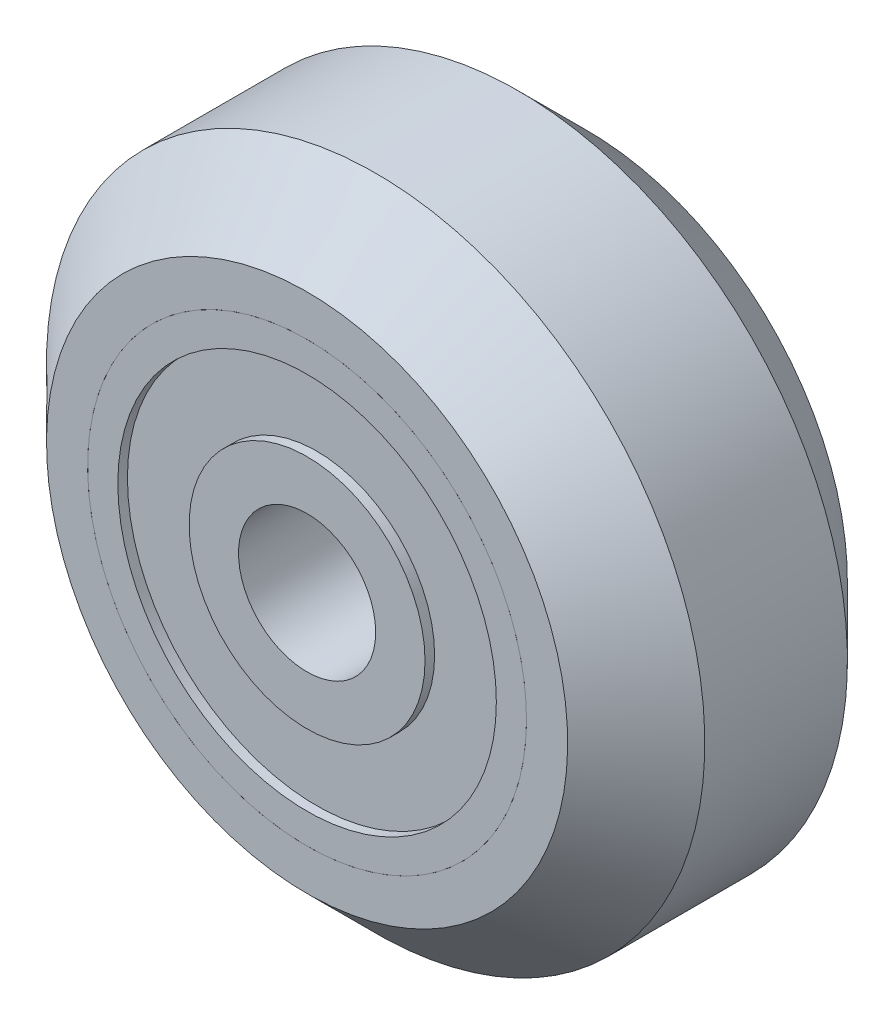
ISO-10303-21;
HEADER;
FILE_DESCRIPTION(('STEP AP214'),'2;1');
FILE_NAME('part.step','',(''),(''),'','','');
FILE_SCHEMA(('AUTOMOTIVE_DESIGN { 1 0 10303 214 1 1 1 1 }'));
ENDSEC;
DATA;
#1=APPLICATION_CONTEXT('core data for automotive mechanical design processes');
#2=APPLICATION_PROTOCOL_DEFINITION('international standard','automotive_design',2000,#1);
#3=PRODUCT_CONTEXT('',#1,'mechanical');
#4=PRODUCT('Part','Part','',(#3));
#5=PRODUCT_RELATED_PRODUCT_CATEGORY('part','',(#4));
#6=PRODUCT_DEFINITION_FORMATION('','',#4);
#7=PRODUCT_DEFINITION_CONTEXT('part definition',#1,'design');
#8=PRODUCT_DEFINITION('design','',#6,#7);
#9=PRODUCT_DEFINITION_SHAPE('','',#8);
#10=(LENGTH_UNIT() NAMED_UNIT(*) SI_UNIT(.MILLI.,.METRE.));
#11=(NAMED_UNIT(*) PLANE_ANGLE_UNIT() SI_UNIT($,.RADIAN.));
#12=(NAMED_UNIT(*) SI_UNIT($,.STERADIAN.) SOLID_ANGLE_UNIT());
#13=UNCERTAINTY_MEASURE_WITH_UNIT(LENGTH_MEASURE(1.E-05),#10,'distance_accuracy_value','');
#14=(GEOMETRIC_REPRESENTATION_CONTEXT(3) GLOBAL_UNCERTAINTY_ASSIGNED_CONTEXT((#13)) GLOBAL_UNIT_ASSIGNED_CONTEXT((#10,
#11,#12)) REPRESENTATION_CONTEXT('',''));
#15=CARTESIAN_POINT('',(0.,0.,0.));
#16=DIRECTION('',(0.,0.,1.));
#17=DIRECTION('',(1.,0.,0.));
#18=AXIS2_PLACEMENT_3D('',#15,#16,#17);
#19=CARTESIAN_POINT('',(3.20287005459411,-0.316292122580969,0.220145997828896));
#20=DIRECTION('',(0.,0.,-1.));
#21=DIRECTION('',(-0.904591859117549,-0.426278744975932,0.));
#22=AXIS2_PLACEMENT_3D('',#19,#20,#21);
#23=PLANE('',#22);
#24=CARTESIAN_POINT('',(3.20287005459411,-0.316292122580969,0.220145997828896));
#25=DIRECTION('',(0.,0.,-1.));
#26=DIRECTION('',(-0.904591859117549,-0.426278744975932,0.));
#27=AXIS2_PLACEMENT_3D('',#24,#25,#26);
#28=CIRCLE('',#27,9.49999999999999);
#29=CARTESIAN_POINT('',(-5.3907526070226,-4.36594019985232,0.220145997828896));
#30=VERTEX_POINT('',#29);
#31=EDGE_CURVE('P0_E21',#30,#30,#28,.F.);
#32=ORIENTED_EDGE('',*,*,#31,.T.);
#33=EDGE_LOOP('',(#32));
#34=FACE_BOUND('',#33,.T.);
#35=CARTESIAN_POINT('',(3.20287005459411,-0.316292122580969,0.220145997828896));
#36=DIRECTION('',(0.,0.,-1.));
#37=DIRECTION('',(-0.904591859117549,-0.426278744975932,0.));
#38=AXIS2_PLACEMENT_3D('',#35,#36,#37);
#39=CIRCLE('',#38,8.);
#40=CARTESIAN_POINT('',(-4.03386481834628,-3.72652208238843,0.220145997828896));
#41=VERTEX_POINT('',#40);
#42=EDGE_CURVE('P0_E38',#41,#41,#39,.T.);
#43=ORIENTED_EDGE('',*,*,#42,.T.);
#44=EDGE_LOOP('',(#43));
#45=FACE_BOUND('',#44,.T.);
#46=ADVANCED_FACE('P0_F14',(#34,#45),#23,.F.);
#47=CARTESIAN_POINT('',(3.20287005459411,-0.316292122580969,-9.97985400217111));
#48=DIRECTION('',(0.,0.,1.));
#49=DIRECTION('',(0.904591859117549,0.426278744975932,0.));
#50=AXIS2_PLACEMENT_3D('',#47,#48,#49);
#51=CYLINDRICAL_SURFACE('',#50,12.);
#52=CARTESIAN_POINT('',(3.20287005459411,-0.316292122580969,-2.27985400217112));
#53=DIRECTION('',(0.,0.,-1.));
#54=DIRECTION('',(-0.904591859117549,-0.426278744975932,0.));
#55=AXIS2_PLACEMENT_3D('',#52,#53,#54);
#56=CIRCLE('',#55,12.);
#57=CARTESIAN_POINT('',(-7.65223225481648,-5.43163706229216,-2.27985400217112));
#58=VERTEX_POINT('',#57);
#59=EDGE_CURVE('P0_E25',#58,#58,#56,.T.);
#60=ORIENTED_EDGE('',*,*,#59,.T.);
#61=EDGE_LOOP('',(#60));
#62=FACE_BOUND('',#61,.T.);
#63=CARTESIAN_POINT('',(3.20287005459411,-0.316292122580969,-7.47985400217109));
#64=DIRECTION('',(0.,0.,-1.));
#65=DIRECTION('',(-0.904591859117549,-0.426278744975932,0.));
#66=AXIS2_PLACEMENT_3D('',#63,#64,#65);
#67=CIRCLE('',#66,12.);
#68=CARTESIAN_POINT('',(-7.65223225481648,-5.43163706229216,-7.47985400217109));
#69=VERTEX_POINT('',#68);
#70=EDGE_CURVE('P0_E29',#69,#69,#67,.F.);
#71=ORIENTED_EDGE('',*,*,#70,.T.);
#72=EDGE_LOOP('',(#71));
#73=FACE_BOUND('',#72,.T.);
#74=ADVANCED_FACE('P0_F70',(#62,#73),#51,.T.);
#75=CARTESIAN_POINT('',(3.20287005459411,-0.316292122580969,-9.97985400217111));
#76=DIRECTION('',(0.,0.,-1.));
#77=DIRECTION('',(-0.904591859117549,-0.426278744975932,0.));
#78=AXIS2_PLACEMENT_3D('',#75,#76,#77);
#79=PLANE('',#78);
#80=CARTESIAN_POINT('',(3.20287005459411,-0.316292122580969,-9.97985400217111));
#81=DIRECTION('',(0.,0.,-1.));
#82=DIRECTION('',(-0.904591859117549,-0.426278744975932,0.));
#83=AXIS2_PLACEMENT_3D('',#80,#81,#82);
#84=CIRCLE('',#83,9.49999999999998);
#85=CARTESIAN_POINT('',(-5.39075260702259,-4.36594019985232,-9.97985400217111));
#86=VERTEX_POINT('',#85);
#87=EDGE_CURVE('P0_E9',#86,#86,#84,.T.);
#88=ORIENTED_EDGE('',*,*,#87,.T.);
#89=EDGE_LOOP('',(#88));
#90=FACE_BOUND('',#89,.T.);
#91=CARTESIAN_POINT('',(3.20287005459411,-0.316292122580969,-9.97985400217111));
#92=DIRECTION('',(0.,0.,-1.));
#93=DIRECTION('',(-0.904591859117549,-0.426278744975932,0.));
#94=AXIS2_PLACEMENT_3D('',#91,#92,#93);
#95=CIRCLE('',#94,8.);
#96=CARTESIAN_POINT('',(-4.03386481834628,-3.72652208238843,-9.97985400217111));
#97=VERTEX_POINT('',#96);
#98=EDGE_CURVE('P0_E40',#97,#97,#95,.T.);
#99=ORIENTED_EDGE('',*,*,#98,.F.);
#100=EDGE_LOOP('',(#99));
#101=FACE_BOUND('',#100,.T.);
#102=ADVANCED_FACE('P0_F65',(#90,#101),#79,.T.);
#103=CARTESIAN_POINT('',(3.20287005459411,-0.316292122580969,-5.2798540021711));
#104=DIRECTION('',(0.,0.,-1.));
#105=DIRECTION('',(-0.904591859117549,-0.426278744975932,0.));
#106=AXIS2_PLACEMENT_3D('',#103,#104,#105);
#107=CYLINDRICAL_SURFACE('',#106,8.);
#108=CARTESIAN_POINT('',(3.20287005459411,-0.316292122580969,-5.2798540021711));
#109=DIRECTION('',(0.,0.,-1.));
#110=DIRECTION('',(-0.904591859117549,-0.426278744975932,0.));
#111=AXIS2_PLACEMENT_3D('',#108,#109,#110);
#112=CIRCLE('',#111,8.);
#113=CARTESIAN_POINT('',(-4.03386481834628,-3.72652208238843,-5.2798540021711));
#114=VERTEX_POINT('',#113);
#115=EDGE_CURVE('P0_E34',#114,#114,#112,.T.);
#116=ORIENTED_EDGE('',*,*,#115,.F.);
#117=EDGE_LOOP('',(#116));
#118=FACE_BOUND('',#117,.T.);
#119=ORIENTED_EDGE('',*,*,#98,.T.);
#120=EDGE_LOOP('',(#119));
#121=FACE_BOUND('',#120,.T.);
#122=ADVANCED_FACE('P0_F59',(#118,#121),#107,.F.);
#123=CARTESIAN_POINT('',(3.20287005459411,-0.316292122580969,-5.2798540021711));
#124=DIRECTION('',(0.,0.,-1.));
#125=DIRECTION('',(-0.904591859117549,-0.426278744975932,0.));
#126=AXIS2_PLACEMENT_3D('',#123,#124,#125);
#127=PLANE('',#126);
#128=CARTESIAN_POINT('',(3.20287005459411,-0.316292122580969,-5.2798540021711));
#129=DIRECTION('',(0.,0.,-1.));
#130=DIRECTION('',(-0.904591859117549,-0.426278744975932,0.));
#131=AXIS2_PLACEMENT_3D('',#128,#129,#130);
#132=CIRCLE('',#131,7.);
#133=CARTESIAN_POINT('',(-3.12927295922873,-3.3002433374125,-5.2798540021711));
#134=VERTEX_POINT('',#133);
#135=EDGE_CURVE('P0_E39',#134,#134,#132,.T.);
#136=ORIENTED_EDGE('',*,*,#135,.F.);
#137=EDGE_LOOP('',(#136));
#138=FACE_BOUND('',#137,.T.);
#139=ORIENTED_EDGE('',*,*,#115,.T.);
#140=EDGE_LOOP('',(#139));
#141=FACE_BOUND('',#140,.T.);
#142=ADVANCED_FACE('P0_F55',(#138,#141),#127,.T.);
#143=CARTESIAN_POINT('',(3.20287005459411,-0.316292122580969,-4.47985400217111));
#144=DIRECTION('',(0.,0.,1.));
#145=DIRECTION('',(0.904591859117549,0.426278744975932,0.));
#146=AXIS2_PLACEMENT_3D('',#143,#144,#145);
#147=CYLINDRICAL_SURFACE('',#146,8.);
#148=CARTESIAN_POINT('',(3.20287005459411,-0.316292122580969,-4.47985400217111));
#149=DIRECTION('',(0.,0.,-1.));
#150=DIRECTION('',(-0.904591859117549,-0.426278744975932,0.));
#151=AXIS2_PLACEMENT_3D('',#148,#149,#150);
#152=CIRCLE('',#151,8.);
#153=CARTESIAN_POINT('',(-4.03386481834628,-3.72652208238843,-4.47985400217111));
#154=VERTEX_POINT('',#153);
#155=EDGE_CURVE('P0_E43',#154,#154,#152,.T.);
#156=ORIENTED_EDGE('',*,*,#155,.T.);
#157=EDGE_LOOP('',(#156));
#158=FACE_BOUND('',#157,.T.);
#159=ORIENTED_EDGE('',*,*,#42,.F.);
#160=EDGE_LOOP('',(#159));
#161=FACE_BOUND('',#160,.T.);
#162=ADVANCED_FACE('P0_F58',(#158,#161),#147,.F.);
#163=CARTESIAN_POINT('',(3.20287005459411,-0.316292122580969,-4.47985400217111));
#164=DIRECTION('',(0.,0.,1.));
#165=DIRECTION('',(-0.904591859117549,-0.426278744975932,0.));
#166=AXIS2_PLACEMENT_3D('',#163,#164,#165);
#167=PLANE('',#166);
#168=CARTESIAN_POINT('',(3.20287005459411,-0.316292122580969,-4.47985400217111));
#169=DIRECTION('',(0.,0.,1.));
#170=DIRECTION('',(0.904591859117549,0.426278744975932,0.));
#171=AXIS2_PLACEMENT_3D('',#168,#169,#170);
#172=CIRCLE('',#171,7.);
#173=CARTESIAN_POINT('',(9.53501306841696,2.66765909225056,-4.47985400217111));
#174=VERTEX_POINT('',#173);
#175=EDGE_CURVE('P0_E35',#174,#174,#172,.T.);
#176=ORIENTED_EDGE('',*,*,#175,.F.);
#177=EDGE_LOOP('',(#176));
#178=FACE_BOUND('',#177,.T.);
#179=ORIENTED_EDGE('',*,*,#155,.F.);
#180=EDGE_LOOP('',(#179));
#181=FACE_BOUND('',#180,.T.);
#182=ADVANCED_FACE('P0_F91',(#178,#181),#167,.T.);
#183=CARTESIAN_POINT('',(3.20287005459411,-0.316292122580969,-2.2798540021711));
#184=DIRECTION('',(0.,0.,-1.));
#185=DIRECTION('',(-0.904591859117549,-0.426278744975932,0.));
#186=AXIS2_PLACEMENT_3D('',#183,#184,#185);
#187=CYLINDRICAL_SURFACE('',#186,7.);
#188=ORIENTED_EDGE('',*,*,#175,.T.);
#189=EDGE_LOOP('',(#188));
#190=FACE_BOUND('',#189,.T.);
#191=ORIENTED_EDGE('',*,*,#135,.T.);
#192=EDGE_LOOP('',(#191));
#193=FACE_BOUND('',#192,.T.);
#194=ADVANCED_FACE('P0_F53',(#190,#193),#187,.F.);
#195=CARTESIAN_POINT('',(3.20287005459411,-0.316292122580969,-2.27985400217112));
#196=DIRECTION('',(0.,0.,-1.));
#197=DIRECTION('',(-0.904591859117549,-0.426278744975932,0.));
#198=AXIS2_PLACEMENT_3D('',#195,#196,#197);
#199=CONICAL_SURFACE('',#198,12.,0.785398163397448);
#200=ORIENTED_EDGE('',*,*,#31,.F.);
#201=EDGE_LOOP('',(#200));
#202=FACE_BOUND('',#201,.T.);
#203=ORIENTED_EDGE('',*,*,#59,.F.);
#204=EDGE_LOOP('',(#203));
#205=FACE_BOUND('',#204,.T.);
#206=ADVANCED_FACE('P0_F83',(#202,#205),#199,.T.);
#207=CARTESIAN_POINT('',(3.20287005459411,-0.316292122580969,-9.97985400217111));
#208=DIRECTION('',(0.,0.,1.));
#209=DIRECTION('',(0.904591859117549,0.426278744975932,0.));
#210=AXIS2_PLACEMENT_3D('',#207,#208,#209);
#211=CONICAL_SURFACE('',#210,9.49999999999998,0.785398163397449);
#212=ORIENTED_EDGE('',*,*,#70,.F.);
#213=EDGE_LOOP('',(#212));
#214=FACE_BOUND('',#213,.T.);
#215=ORIENTED_EDGE('',*,*,#87,.F.);
#216=EDGE_LOOP('',(#215));
#217=FACE_BOUND('',#216,.T.);
#218=ADVANCED_FACE('P0_F16',(#214,#217),#211,.T.);
#219=CLOSED_SHELL('',(#46,#74,#102,#122,#142,#162,#182,#194,#206,#218));
#220=MANIFOLD_SOLID_BREP('P0_B1',#219);
#221=CARTESIAN_POINT('',(1.91376746145823,7.57916318438964,-9.97985400217111));
#222=DIRECTION('',(0.,0.,1.));
#223=DIRECTION('',(0.986931913371326,0.161137824141986,0.));
#224=AXIS2_PLACEMENT_3D('',#221,#222,#223);
#225=PLANE('',#224);
#226=CARTESIAN_POINT('',(3.20287005459411,-0.316292122580969,-9.97985400217111));
#227=DIRECTION('',(0.,0.,1.));
#228=DIRECTION('',(0.986931913371326,0.161137824141986,0.));
#229=AXIS2_PLACEMENT_3D('',#226,#227,#228);
#230=CIRCLE('',#229,8.);
#231=CARTESIAN_POINT('',(11.0983253615647,0.972810470554918,-9.97985400217111));
#232=VERTEX_POINT('',#231);
#233=EDGE_CURVE('P1_E55',#232,#232,#230,.T.);
#234=ORIENTED_EDGE('',*,*,#233,.F.);
#235=EDGE_LOOP('',(#234));
#236=FACE_BOUND('',#235,.T.);
#237=CARTESIAN_POINT('',(3.20287005459411,-0.316292122580969,-9.97985400217111));
#238=DIRECTION('',(0.,0.,1.));
#239=DIRECTION('',(0.986931913371326,0.161137824141986,0.));
#240=AXIS2_PLACEMENT_3D('',#237,#238,#239);
#241=CIRCLE('',#240,6.9);
#242=CARTESIAN_POINT('',(10.0127002568563,0.795558863998733,-9.97985400217111));
#243=VERTEX_POINT('',#242);
#244=EDGE_CURVE('P1_E10',#243,#243,#241,.T.);
#245=ORIENTED_EDGE('',*,*,#244,.T.);
#246=EDGE_LOOP('',(#245));
#247=FACE_BOUND('',#246,.T.);
#248=ADVANCED_FACE('P1_F15',(#236,#247),#225,.F.);
#249=CARTESIAN_POINT('',(3.20287005459411,-0.316292122580969,4.54881983295434));
#250=DIRECTION('',(0.,0.,1.));
#251=DIRECTION('',(0.986931913371326,0.161137824141986,0.));
#252=AXIS2_PLACEMENT_3D('',#249,#250,#251);
#253=CYLINDRICAL_SURFACE('',#252,6.9);
#254=ORIENTED_EDGE('',*,*,#244,.F.);
#255=EDGE_LOOP('',(#254));
#256=FACE_BOUND('',#255,.T.);
#257=CARTESIAN_POINT('',(3.20287005459411,-0.316292122580969,-9.62985400217111));
#258=DIRECTION('',(0.,0.,1.));
#259=DIRECTION('',(0.986931913371326,0.161137824141986,0.));
#260=AXIS2_PLACEMENT_3D('',#257,#258,#259);
#261=CIRCLE('',#260,6.9);
#262=CARTESIAN_POINT('',(10.0127002568563,0.795558863998733,-9.62985400217111));
#263=VERTEX_POINT('',#262);
#264=EDGE_CURVE('P1_E21',#263,#263,#261,.T.);
#265=ORIENTED_EDGE('',*,*,#264,.T.);
#266=EDGE_LOOP('',(#265));
#267=FACE_BOUND('',#266,.T.);
#268=ADVANCED_FACE('P1_F62',(#256,#267),#253,.F.);
#269=CARTESIAN_POINT('',(2.09101906801441,6.49353807968118,-9.62985400217111));
#270=DIRECTION('',(0.,0.,1.));
#271=DIRECTION('',(0.986931913371326,0.161137824141986,0.));
#272=AXIS2_PLACEMENT_3D('',#269,#270,#271);
#273=PLANE('',#272);
#274=ORIENTED_EDGE('',*,*,#264,.F.);
#275=EDGE_LOOP('',(#274));
#276=FACE_BOUND('',#275,.T.);
#277=CARTESIAN_POINT('',(3.20287005459411,-0.316292122580969,-9.62985400217111));
#278=DIRECTION('',(0.,0.,1.));
#279=DIRECTION('',(0.986931913371326,0.161137824141986,0.));
#280=AXIS2_PLACEMENT_3D('',#277,#278,#279);
#281=CIRCLE('',#280,4.3);
#282=CARTESIAN_POINT('',(7.44667728209081,0.37660052122957,-9.62985400217111));
#283=VERTEX_POINT('',#282);
#284=EDGE_CURVE('P1_E25',#283,#283,#281,.T.);
#285=ORIENTED_EDGE('',*,*,#284,.T.);
#286=EDGE_LOOP('',(#285));
#287=FACE_BOUND('',#286,.T.);
#288=ADVANCED_FACE('P1_F67',(#276,#287),#273,.F.);
#289=CARTESIAN_POINT('',(3.20287005459411,-0.316292122580969,4.54881983295434));
#290=DIRECTION('',(0.,0.,1.));
#291=DIRECTION('',(0.986931913371326,0.161137824141986,0.));
#292=AXIS2_PLACEMENT_3D('',#289,#290,#291);
#293=CYLINDRICAL_SURFACE('',#292,4.3);
#294=ORIENTED_EDGE('',*,*,#284,.F.);
#295=EDGE_LOOP('',(#294));
#296=FACE_BOUND('',#295,.T.);
#297=CARTESIAN_POINT('',(3.20287005459411,-0.316292122580969,-9.97985400217111));
#298=DIRECTION('',(0.,0.,1.));
#299=DIRECTION('',(0.986931913371326,0.161137824141986,0.));
#300=AXIS2_PLACEMENT_3D('',#297,#298,#299);
#301=CIRCLE('',#300,4.3);
#302=CARTESIAN_POINT('',(7.44667728209081,0.37660052122957,-9.97985400217111));
#303=VERTEX_POINT('',#302);
#304=EDGE_CURVE('P1_E29',#303,#303,#301,.T.);
#305=ORIENTED_EDGE('',*,*,#304,.T.);
#306=EDGE_LOOP('',(#305));
#307=FACE_BOUND('',#306,.T.);
#308=ADVANCED_FACE('P1_F72',(#296,#307),#293,.T.);
#309=CARTESIAN_POINT('',(2.50997741078357,3.92751510491573,-9.97985400217111));
#310=DIRECTION('',(0.,0.,1.));
#311=DIRECTION('',(0.986931913371326,0.161137824141986,0.));
#312=AXIS2_PLACEMENT_3D('',#309,#310,#311);
#313=PLANE('',#312);
#314=ORIENTED_EDGE('',*,*,#304,.F.);
#315=EDGE_LOOP('',(#314));
#316=FACE_BOUND('',#315,.T.);
#317=CARTESIAN_POINT('',(3.20287005459411,-0.316292122580969,-9.97985400217111));
#318=DIRECTION('',(0.,0.,1.));
#319=DIRECTION('',(0.986931913371326,0.161137824141986,0.));
#320=AXIS2_PLACEMENT_3D('',#317,#318,#319);
#321=CIRCLE('',#320,2.5);
#322=CARTESIAN_POINT('',(5.67019983802243,0.0865524377739955,-9.97985400217111));
#323=VERTEX_POINT('',#322);
#324=EDGE_CURVE('P1_E34',#323,#323,#321,.T.);
#325=ORIENTED_EDGE('',*,*,#324,.T.);
#326=EDGE_LOOP('',(#325));
#327=FACE_BOUND('',#326,.T.);
#328=ADVANCED_FACE('P1_F78',(#316,#327),#313,.F.);
#329=CARTESIAN_POINT('',(3.20287005459411,-0.316292122580969,4.54881983295434));
#330=DIRECTION('',(0.,0.,1.));
#331=DIRECTION('',(0.986931913371326,0.161137824141986,0.));
#332=AXIS2_PLACEMENT_3D('',#329,#330,#331);
#333=CYLINDRICAL_SURFACE('',#332,2.5);
#334=ORIENTED_EDGE('',*,*,#324,.F.);
#335=EDGE_LOOP('',(#334));
#336=FACE_BOUND('',#335,.T.);
#337=CARTESIAN_POINT('',(3.20287005459411,-0.316292122580969,-4.97985400217111));
#338=DIRECTION('',(0.,0.,1.));
#339=DIRECTION('',(0.986931913371326,0.161137824141986,0.));
#340=AXIS2_PLACEMENT_3D('',#337,#338,#339);
#341=CIRCLE('',#340,2.5);
#342=CARTESIAN_POINT('',(5.67019983802243,0.0865524377739955,-4.97985400217111));
#343=VERTEX_POINT('',#342);
#344=EDGE_CURVE('P1_E37',#343,#343,#341,.T.);
#345=ORIENTED_EDGE('',*,*,#344,.T.);
#346=EDGE_LOOP('',(#345));
#347=FACE_BOUND('',#346,.T.);
#348=ADVANCED_FACE('P1_F82',(#336,#347),#333,.F.);
#349=CARTESIAN_POINT('',(2.50997741078357,3.92751510491573,-4.97985400217111));
#350=DIRECTION('',(0.,0.,-1.));
#351=DIRECTION('',(-0.986931913371326,-0.161137824141986,0.));
#352=AXIS2_PLACEMENT_3D('',#349,#350,#351);
#353=PLANE('',#352);
#354=ORIENTED_EDGE('',*,*,#344,.F.);
#355=EDGE_LOOP('',(#354));
#356=FACE_BOUND('',#355,.T.);
#357=CARTESIAN_POINT('',(3.20287005459411,-0.316292122580969,-4.97985400217111));
#358=DIRECTION('',(0.,0.,1.));
#359=DIRECTION('',(0.986931913371326,0.161137824141986,0.));
#360=AXIS2_PLACEMENT_3D('',#357,#358,#359);
#361=CIRCLE('',#360,4.3);
#362=CARTESIAN_POINT('',(7.44667728209081,0.37660052122957,-4.97985400217111));
#363=VERTEX_POINT('',#362);
#364=EDGE_CURVE('P1_E40',#363,#363,#361,.T.);
#365=ORIENTED_EDGE('',*,*,#364,.T.);
#366=EDGE_LOOP('',(#365));
#367=FACE_BOUND('',#366,.T.);
#368=ADVANCED_FACE('P1_F86',(#356,#367),#353,.F.);
#369=CARTESIAN_POINT('',(3.20287005459411,-0.316292122580969,4.54881983295434));
#370=DIRECTION('',(0.,0.,1.));
#371=DIRECTION('',(0.986931913371326,0.161137824141986,0.));
#372=AXIS2_PLACEMENT_3D('',#369,#370,#371);
#373=CYLINDRICAL_SURFACE('',#372,4.3);
#374=ORIENTED_EDGE('',*,*,#364,.F.);
#375=EDGE_LOOP('',(#374));
#376=FACE_BOUND('',#375,.T.);
#377=CARTESIAN_POINT('',(3.20287005459411,-0.316292122580969,-5.32985400217111));
#378=DIRECTION('',(0.,0.,1.));
#379=DIRECTION('',(0.986931913371326,0.161137824141986,0.));
#380=AXIS2_PLACEMENT_3D('',#377,#378,#379);
#381=CIRCLE('',#380,4.3);
#382=CARTESIAN_POINT('',(7.44667728209081,0.37660052122957,-5.32985400217111));
#383=VERTEX_POINT('',#382);
#384=EDGE_CURVE('P1_E43',#383,#383,#381,.T.);
#385=ORIENTED_EDGE('',*,*,#384,.T.);
#386=EDGE_LOOP('',(#385));
#387=FACE_BOUND('',#386,.T.);
#388=ADVANCED_FACE('P1_F90',(#376,#387),#373,.T.);
#389=CARTESIAN_POINT('',(2.09101906801441,6.49353807968118,-5.32985400217111));
#390=DIRECTION('',(0.,0.,-1.));
#391=DIRECTION('',(-0.986931913371326,-0.161137824141986,0.));
#392=AXIS2_PLACEMENT_3D('',#389,#390,#391);
#393=PLANE('',#392);
#394=ORIENTED_EDGE('',*,*,#384,.F.);
#395=EDGE_LOOP('',(#394));
#396=FACE_BOUND('',#395,.T.);
#397=CARTESIAN_POINT('',(3.20287005459411,-0.316292122580969,-5.32985400217111));
#398=DIRECTION('',(0.,0.,1.));
#399=DIRECTION('',(0.986931913371326,0.161137824141986,0.));
#400=AXIS2_PLACEMENT_3D('',#397,#398,#399);
#401=CIRCLE('',#400,6.9);
#402=CARTESIAN_POINT('',(10.0127002568563,0.795558863998733,-5.32985400217111));
#403=VERTEX_POINT('',#402);
#404=EDGE_CURVE('P1_E46',#403,#403,#401,.T.);
#405=ORIENTED_EDGE('',*,*,#404,.T.);
#406=EDGE_LOOP('',(#405));
#407=FACE_BOUND('',#406,.T.);
#408=ADVANCED_FACE('P1_F94',(#396,#407),#393,.F.);
#409=CARTESIAN_POINT('',(3.20287005459411,-0.316292122580969,4.54881983295434));
#410=DIRECTION('',(0.,0.,1.));
#411=DIRECTION('',(0.986931913371326,0.161137824141986,0.));
#412=AXIS2_PLACEMENT_3D('',#409,#410,#411);
#413=CYLINDRICAL_SURFACE('',#412,6.9);
#414=ORIENTED_EDGE('',*,*,#404,.F.);
#415=EDGE_LOOP('',(#414));
#416=FACE_BOUND('',#415,.T.);
#417=CARTESIAN_POINT('',(3.20287005459411,-0.316292122580969,-4.97985400217111));
#418=DIRECTION('',(0.,0.,1.));
#419=DIRECTION('',(0.986931913371326,0.161137824141986,0.));
#420=AXIS2_PLACEMENT_3D('',#417,#418,#419);
#421=CIRCLE('',#420,6.9);
#422=CARTESIAN_POINT('',(10.0127002568563,0.795558863998733,-4.97985400217111));
#423=VERTEX_POINT('',#422);
#424=EDGE_CURVE('P1_E49',#423,#423,#421,.T.);
#425=ORIENTED_EDGE('',*,*,#424,.T.);
#426=EDGE_LOOP('',(#425));
#427=FACE_BOUND('',#426,.T.);
#428=ADVANCED_FACE('P1_F98',(#416,#427),#413,.F.);
#429=CARTESIAN_POINT('',(1.91376746145823,7.57916318438964,-4.97985400217111));
#430=DIRECTION('',(0.,0.,-1.));
#431=DIRECTION('',(-0.986931913371326,-0.161137824141986,0.));
#432=AXIS2_PLACEMENT_3D('',#429,#430,#431);
#433=PLANE('',#432);
#434=ORIENTED_EDGE('',*,*,#424,.F.);
#435=EDGE_LOOP('',(#434));
#436=FACE_BOUND('',#435,.T.);
#437=CARTESIAN_POINT('',(3.20287005459411,-0.316292122580969,-4.97985400217111));
#438=DIRECTION('',(0.,0.,1.));
#439=DIRECTION('',(0.986931913371326,0.161137824141986,0.));
#440=AXIS2_PLACEMENT_3D('',#437,#438,#439);
#441=CIRCLE('',#440,8.);
#442=CARTESIAN_POINT('',(11.0983253615647,0.972810470554918,-4.97985400217111));
#443=VERTEX_POINT('',#442);
#444=EDGE_CURVE('P1_E52',#443,#443,#441,.T.);
#445=ORIENTED_EDGE('',*,*,#444,.T.);
#446=EDGE_LOOP('',(#445));
#447=FACE_BOUND('',#446,.T.);
#448=ADVANCED_FACE('P1_F102',(#436,#447),#433,.F.);
#449=CARTESIAN_POINT('',(3.20287005459411,-0.316292122580969,4.54881983295434));
#450=DIRECTION('',(0.,0.,1.));
#451=DIRECTION('',(0.986931913371326,0.161137824141986,0.));
#452=AXIS2_PLACEMENT_3D('',#449,#450,#451);
#453=CYLINDRICAL_SURFACE('',#452,8.);
#454=ORIENTED_EDGE('',*,*,#444,.F.);
#455=EDGE_LOOP('',(#454));
#456=FACE_BOUND('',#455,.T.);
#457=ORIENTED_EDGE('',*,*,#233,.T.);
#458=EDGE_LOOP('',(#457));
#459=FACE_BOUND('',#458,.T.);
#460=ADVANCED_FACE('P1_F59',(#456,#459),#453,.T.);
#461=CLOSED_SHELL('',(#248,#268,#288,#308,#328,#348,#368,#388,#408,#428,#448,#460));
#462=MANIFOLD_SOLID_BREP('P1_B1',#461);
#463=CARTESIAN_POINT('',(3.20287005459411,7.68370787741903,-4.7798540021711));
#464=DIRECTION('',(0.,0.,1.));
#465=DIRECTION('',(1.,0.,0.));
#466=AXIS2_PLACEMENT_3D('',#463,#464,#465);
#467=PLANE('',#466);
#468=CARTESIAN_POINT('',(3.20287005459411,-0.316292122580969,-4.7798540021711));
#469=DIRECTION('',(0.,0.,1.));
#470=DIRECTION('',(1.,0.,0.));
#471=AXIS2_PLACEMENT_3D('',#468,#469,#470);
#472=CIRCLE('',#471,8.);
#473=CARTESIAN_POINT('',(11.2028700545941,-0.316292122580969,-4.7798540021711));
#474=VERTEX_POINT('',#473);
#475=EDGE_CURVE('P2_E55',#474,#474,#472,.T.);
#476=ORIENTED_EDGE('',*,*,#475,.F.);
#477=EDGE_LOOP('',(#476));
#478=FACE_BOUND('',#477,.T.);
#479=CARTESIAN_POINT('',(3.20287005459411,-0.316292122580969,-4.7798540021711));
#480=DIRECTION('',(0.,0.,1.));
#481=DIRECTION('',(1.,0.,0.));
#482=AXIS2_PLACEMENT_3D('',#479,#480,#481);
#483=CIRCLE('',#482,6.9);
#484=CARTESIAN_POINT('',(10.1028700545941,-0.316292122580969,-4.7798540021711));
#485=VERTEX_POINT('',#484);
#486=EDGE_CURVE('P2_E10',#485,#485,#483,.T.);
#487=ORIENTED_EDGE('',*,*,#486,.T.);
#488=EDGE_LOOP('',(#487));
#489=FACE_BOUND('',#488,.T.);
#490=ADVANCED_FACE('P2_F15',(#478,#489),#467,.F.);
#491=CARTESIAN_POINT('',(3.20287005459411,-0.316292122580969,9.74881983295435));
#492=DIRECTION('',(0.,0.,1.));
#493=DIRECTION('',(1.,0.,0.));
#494=AXIS2_PLACEMENT_3D('',#491,#492,#493);
#495=CYLINDRICAL_SURFACE('',#494,6.9);
#496=ORIENTED_EDGE('',*,*,#486,.F.);
#497=EDGE_LOOP('',(#496));
#498=FACE_BOUND('',#497,.T.);
#499=CARTESIAN_POINT('',(3.20287005459411,-0.316292122580969,-4.4298540021711));
#500=DIRECTION('',(0.,0.,1.));
#501=DIRECTION('',(1.,0.,0.));
#502=AXIS2_PLACEMENT_3D('',#499,#500,#501);
#503=CIRCLE('',#502,6.9);
#504=CARTESIAN_POINT('',(10.1028700545941,-0.316292122580969,-4.4298540021711));
#505=VERTEX_POINT('',#504);
#506=EDGE_CURVE('P2_E21',#505,#505,#503,.T.);
#507=ORIENTED_EDGE('',*,*,#506,.T.);
#508=EDGE_LOOP('',(#507));
#509=FACE_BOUND('',#508,.T.);
#510=ADVANCED_FACE('P2_F62',(#498,#509),#495,.F.);
#511=CARTESIAN_POINT('',(3.20287005459411,6.58370787741903,-4.4298540021711));
#512=DIRECTION('',(0.,0.,1.));
#513=DIRECTION('',(1.,0.,0.));
#514=AXIS2_PLACEMENT_3D('',#511,#512,#513);
#515=PLANE('',#514);
#516=ORIENTED_EDGE('',*,*,#506,.F.);
#517=EDGE_LOOP('',(#516));
#518=FACE_BOUND('',#517,.T.);
#519=CARTESIAN_POINT('',(3.20287005459411,-0.316292122580969,-4.4298540021711));
#520=DIRECTION('',(0.,0.,1.));
#521=DIRECTION('',(1.,0.,0.));
#522=AXIS2_PLACEMENT_3D('',#519,#520,#521);
#523=CIRCLE('',#522,4.3);
#524=CARTESIAN_POINT('',(7.50287005459411,-0.316292122580969,-4.4298540021711));
#525=VERTEX_POINT('',#524);
#526=EDGE_CURVE('P2_E25',#525,#525,#523,.T.);
#527=ORIENTED_EDGE('',*,*,#526,.T.);
#528=EDGE_LOOP('',(#527));
#529=FACE_BOUND('',#528,.T.);
#530=ADVANCED_FACE('P2_F67',(#518,#529),#515,.F.);
#531=CARTESIAN_POINT('',(3.20287005459411,-0.316292122580969,9.74881983295435));
#532=DIRECTION('',(0.,0.,1.));
#533=DIRECTION('',(1.,0.,0.));
#534=AXIS2_PLACEMENT_3D('',#531,#532,#533);
#535=CYLINDRICAL_SURFACE('',#534,4.3);
#536=ORIENTED_EDGE('',*,*,#526,.F.);
#537=EDGE_LOOP('',(#536));
#538=FACE_BOUND('',#537,.T.);
#539=CARTESIAN_POINT('',(3.20287005459411,-0.316292122580969,-4.7798540021711));
#540=DIRECTION('',(0.,0.,1.));
#541=DIRECTION('',(1.,0.,0.));
#542=AXIS2_PLACEMENT_3D('',#539,#540,#541);
#543=CIRCLE('',#542,4.3);
#544=CARTESIAN_POINT('',(7.50287005459411,-0.316292122580969,-4.7798540021711));
#545=VERTEX_POINT('',#544);
#546=EDGE_CURVE('P2_E29',#545,#545,#543,.T.);
#547=ORIENTED_EDGE('',*,*,#546,.T.);
#548=EDGE_LOOP('',(#547));
#549=FACE_BOUND('',#548,.T.);
#550=ADVANCED_FACE('P2_F72',(#538,#549),#535,.T.);
#551=CARTESIAN_POINT('',(3.20287005459411,3.98370787741903,-4.7798540021711));
#552=DIRECTION('',(0.,0.,1.));
#553=DIRECTION('',(1.,0.,0.));
#554=AXIS2_PLACEMENT_3D('',#551,#552,#553);
#555=PLANE('',#554);
#556=ORIENTED_EDGE('',*,*,#546,.F.);
#557=EDGE_LOOP('',(#556));
#558=FACE_BOUND('',#557,.T.);
#559=CARTESIAN_POINT('',(3.20287005459411,-0.316292122580969,-4.7798540021711));
#560=DIRECTION('',(0.,0.,1.));
#561=DIRECTION('',(1.,0.,0.));
#562=AXIS2_PLACEMENT_3D('',#559,#560,#561);
#563=CIRCLE('',#562,2.5);
#564=CARTESIAN_POINT('',(5.70287005459411,-0.316292122580969,-4.7798540021711));
#565=VERTEX_POINT('',#564);
#566=EDGE_CURVE('P2_E34',#565,#565,#563,.T.);
#567=ORIENTED_EDGE('',*,*,#566,.T.);
#568=EDGE_LOOP('',(#567));
#569=FACE_BOUND('',#568,.T.);
#570=ADVANCED_FACE('P2_F78',(#558,#569),#555,.F.);
#571=CARTESIAN_POINT('',(3.20287005459411,-0.316292122580969,9.74881983295435));
#572=DIRECTION('',(0.,0.,1.));
#573=DIRECTION('',(1.,0.,0.));
#574=AXIS2_PLACEMENT_3D('',#571,#572,#573);
#575=CYLINDRICAL_SURFACE('',#574,2.5);
#576=ORIENTED_EDGE('',*,*,#566,.F.);
#577=EDGE_LOOP('',(#576));
#578=FACE_BOUND('',#577,.T.);
#579=CARTESIAN_POINT('',(3.20287005459411,-0.316292122580969,0.220145997828897));
#580=DIRECTION('',(0.,0.,1.));
#581=DIRECTION('',(1.,0.,0.));
#582=AXIS2_PLACEMENT_3D('',#579,#580,#581);
#583=CIRCLE('',#582,2.5);
#584=CARTESIAN_POINT('',(5.70287005459411,-0.316292122580969,0.220145997828897));
#585=VERTEX_POINT('',#584);
#586=EDGE_CURVE('P2_E37',#585,#585,#583,.T.);
#587=ORIENTED_EDGE('',*,*,#586,.T.);
#588=EDGE_LOOP('',(#587));
#589=FACE_BOUND('',#588,.T.);
#590=ADVANCED_FACE('P2_F82',(#578,#589),#575,.F.);
#591=CARTESIAN_POINT('',(3.20287005459411,3.98370787741903,0.220145997828898));
#592=DIRECTION('',(0.,0.,-1.));
#593=DIRECTION('',(-1.,0.,0.));
#594=AXIS2_PLACEMENT_3D('',#591,#592,#593);
#595=PLANE('',#594);
#596=ORIENTED_EDGE('',*,*,#586,.F.);
#597=EDGE_LOOP('',(#596));
#598=FACE_BOUND('',#597,.T.);
#599=CARTESIAN_POINT('',(3.20287005459411,-0.316292122580969,0.220145997828897));
#600=DIRECTION('',(0.,0.,1.));
#601=DIRECTION('',(1.,0.,0.));
#602=AXIS2_PLACEMENT_3D('',#599,#600,#601);
#603=CIRCLE('',#602,4.3);
#604=CARTESIAN_POINT('',(7.50287005459411,-0.316292122580969,0.220145997828897));
#605=VERTEX_POINT('',#604);
#606=EDGE_CURVE('P2_E40',#605,#605,#603,.T.);
#607=ORIENTED_EDGE('',*,*,#606,.T.);
#608=EDGE_LOOP('',(#607));
#609=FACE_BOUND('',#608,.T.);
#610=ADVANCED_FACE('P2_F86',(#598,#609),#595,.F.);
#611=CARTESIAN_POINT('',(3.20287005459411,-0.316292122580969,9.74881983295435));
#612=DIRECTION('',(0.,0.,1.));
#613=DIRECTION('',(1.,0.,0.));
#614=AXIS2_PLACEMENT_3D('',#611,#612,#613);
#615=CYLINDRICAL_SURFACE('',#614,4.3);
#616=ORIENTED_EDGE('',*,*,#606,.F.);
#617=EDGE_LOOP('',(#616));
#618=FACE_BOUND('',#617,.T.);
#619=CARTESIAN_POINT('',(3.20287005459411,-0.316292122580969,-0.129854002171102));
#620=DIRECTION('',(0.,0.,1.));
#621=DIRECTION('',(1.,0.,0.));
#622=AXIS2_PLACEMENT_3D('',#619,#620,#621);
#623=CIRCLE('',#622,4.3);
#624=CARTESIAN_POINT('',(7.50287005459411,-0.316292122580969,-0.129854002171102));
#625=VERTEX_POINT('',#624);
#626=EDGE_CURVE('P2_E43',#625,#625,#623,.T.);
#627=ORIENTED_EDGE('',*,*,#626,.T.);
#628=EDGE_LOOP('',(#627));
#629=FACE_BOUND('',#628,.T.);
#630=ADVANCED_FACE('P2_F90',(#618,#629),#615,.T.);
#631=CARTESIAN_POINT('',(3.20287005459411,6.58370787741903,-0.129854002171103));
#632=DIRECTION('',(0.,0.,-1.));
#633=DIRECTION('',(-1.,0.,0.));
#634=AXIS2_PLACEMENT_3D('',#631,#632,#633);
#635=PLANE('',#634);
#636=ORIENTED_EDGE('',*,*,#626,.F.);
#637=EDGE_LOOP('',(#636));
#638=FACE_BOUND('',#637,.T.);
#639=CARTESIAN_POINT('',(3.20287005459411,-0.316292122580969,-0.129854002171102));
#640=DIRECTION('',(0.,0.,1.));
#641=DIRECTION('',(1.,0.,0.));
#642=AXIS2_PLACEMENT_3D('',#639,#640,#641);
#643=CIRCLE('',#642,6.9);
#644=CARTESIAN_POINT('',(10.1028700545941,-0.316292122580969,-0.129854002171102));
#645=VERTEX_POINT('',#644);
#646=EDGE_CURVE('P2_E46',#645,#645,#643,.T.);
#647=ORIENTED_EDGE('',*,*,#646,.T.);
#648=EDGE_LOOP('',(#647));
#649=FACE_BOUND('',#648,.T.);
#650=ADVANCED_FACE('P2_F94',(#638,#649),#635,.F.);
#651=CARTESIAN_POINT('',(3.20287005459411,-0.316292122580969,9.74881983295435));
#652=DIRECTION('',(0.,0.,1.));
#653=DIRECTION('',(1.,0.,0.));
#654=AXIS2_PLACEMENT_3D('',#651,#652,#653);
#655=CYLINDRICAL_SURFACE('',#654,6.9);
#656=ORIENTED_EDGE('',*,*,#646,.F.);
#657=EDGE_LOOP('',(#656));
#658=FACE_BOUND('',#657,.T.);
#659=CARTESIAN_POINT('',(3.20287005459411,-0.316292122580969,0.220145997828897));
#660=DIRECTION('',(0.,0.,1.));
#661=DIRECTION('',(1.,0.,0.));
#662=AXIS2_PLACEMENT_3D('',#659,#660,#661);
#663=CIRCLE('',#662,6.9);
#664=CARTESIAN_POINT('',(10.1028700545941,-0.316292122580969,0.220145997828897));
#665=VERTEX_POINT('',#664);
#666=EDGE_CURVE('P2_E49',#665,#665,#663,.T.);
#667=ORIENTED_EDGE('',*,*,#666,.T.);
#668=EDGE_LOOP('',(#667));
#669=FACE_BOUND('',#668,.T.);
#670=ADVANCED_FACE('P2_F98',(#658,#669),#655,.F.);
#671=CARTESIAN_POINT('',(3.20287005459411,7.68370787741903,0.220145997828897));
#672=DIRECTION('',(0.,0.,-1.));
#673=DIRECTION('',(-1.,0.,0.));
#674=AXIS2_PLACEMENT_3D('',#671,#672,#673);
#675=PLANE('',#674);
#676=ORIENTED_EDGE('',*,*,#666,.F.);
#677=EDGE_LOOP('',(#676));
#678=FACE_BOUND('',#677,.T.);
#679=CARTESIAN_POINT('',(3.20287005459411,-0.316292122580969,0.220145997828897));
#680=DIRECTION('',(0.,0.,1.));
#681=DIRECTION('',(1.,0.,0.));
#682=AXIS2_PLACEMENT_3D('',#679,#680,#681);
#683=CIRCLE('',#682,8.);
#684=CARTESIAN_POINT('',(11.2028700545941,-0.316292122580969,0.220145997828897));
#685=VERTEX_POINT('',#684);
#686=EDGE_CURVE('P2_E52',#685,#685,#683,.T.);
#687=ORIENTED_EDGE('',*,*,#686,.T.);
#688=EDGE_LOOP('',(#687));
#689=FACE_BOUND('',#688,.T.);
#690=ADVANCED_FACE('P2_F102',(#678,#689),#675,.F.);
#691=CARTESIAN_POINT('',(3.20287005459411,-0.316292122580969,9.74881983295435));
#692=DIRECTION('',(0.,0.,1.));
#693=DIRECTION('',(1.,0.,0.));
#694=AXIS2_PLACEMENT_3D('',#691,#692,#693);
#695=CYLINDRICAL_SURFACE('',#694,8.);
#696=ORIENTED_EDGE('',*,*,#686,.F.);
#697=EDGE_LOOP('',(#696));
#698=FACE_BOUND('',#697,.T.);
#699=ORIENTED_EDGE('',*,*,#475,.T.);
#700=EDGE_LOOP('',(#699));
#701=FACE_BOUND('',#700,.T.);
#702=ADVANCED_FACE('P2_F59',(#698,#701),#695,.T.);
#703=CLOSED_SHELL('',(#490,#510,#530,#550,#570,#590,#610,#630,#650,#670,#690,#702));
#704=MANIFOLD_SOLID_BREP('P2_B1',#703);
#705=CARTESIAN_POINT('',(3.20287005459411,-0.316292122580969,-5.3798540021711));
#706=DIRECTION('',(0.,0.,1.));
#707=DIRECTION('',(-1.,0.,0.));
#708=AXIS2_PLACEMENT_3D('',#705,#706,#707);
#709=CYLINDRICAL_SURFACE('',#708,2.6);
#710=CARTESIAN_POINT('',(3.20287005459411,-0.316292122580969,-5.3798540021711));
#711=DIRECTION('',(0.,0.,1.));
#712=DIRECTION('',(-1.,0.,0.));
#713=AXIS2_PLACEMENT_3D('',#710,#711,#712);
#714=CIRCLE('',#713,2.6);
#715=CARTESIAN_POINT('',(5.80287005459411,-0.316292122580969,-5.3798540021711));
#716=VERTEX_POINT('',#715);
#717=EDGE_CURVE('P3_E39',#716,#716,#714,.T.);
#718=ORIENTED_EDGE('',*,*,#717,.F.);
#719=DIRECTION('',(0.,0.,1.));
#720=VECTOR('',#719,1.);
#721=CARTESIAN_POINT('',(5.80287005459411,-0.316292122580969,-5.3798540021711));
#722=LINE('',#721,#720);
#723=CARTESIAN_POINT('',(5.80287005459411,-0.316292122580969,-4.3798540021711));
#724=VERTEX_POINT('',#723);
#725=EDGE_CURVE('P3_E11',#716,#724,#722,.T.);
#726=ORIENTED_EDGE('',*,*,#725,.T.);
#727=CARTESIAN_POINT('',(3.20287005459411,-0.316292122580969,-4.3798540021711));
#728=DIRECTION('',(0.,0.,-1.));
#729=DIRECTION('',(-1.,0.,0.));
#730=AXIS2_PLACEMENT_3D('',#727,#728,#729);
#731=CIRCLE('',#730,2.6);
#732=EDGE_CURVE('P3_E69',#724,#724,#731,.T.);
#733=ORIENTED_EDGE('',*,*,#732,.F.);
#734=ORIENTED_EDGE('',*,*,#725,.F.);
#735=EDGE_LOOP('',(#718,#726,#733,#734));
#736=FACE_BOUND('',#735,.T.);
#737=ADVANCED_FACE('P3_F17',(#736),#709,.F.);
#738=CARTESIAN_POINT('',(3.20287005459411,-0.316292122580969,-5.3798540021711));
#739=DIRECTION('',(0.,0.,1.));
#740=DIRECTION('',(-1.,0.,0.));
#741=AXIS2_PLACEMENT_3D('',#738,#739,#740);
#742=CYLINDRICAL_SURFACE('',#741,5.);
#743=CARTESIAN_POINT('',(3.20287005459411,-0.316292122580969,-4.3798540021711));
#744=DIRECTION('',(0.,0.,1.));
#745=DIRECTION('',(-1.,0.,0.));
#746=AXIS2_PLACEMENT_3D('',#743,#744,#745);
#747=CIRCLE('',#746,5.);
#748=CARTESIAN_POINT('',(8.20287005459411,-0.316292122580969,-4.3798540021711));
#749=VERTEX_POINT('',#748);
#750=EDGE_CURVE('P3_E52',#749,#749,#747,.T.);
#751=ORIENTED_EDGE('',*,*,#750,.F.);
#752=DIRECTION('',(0.,0.,-1.));
#753=VECTOR('',#752,1.);
#754=CARTESIAN_POINT('',(8.20287005459411,-0.316292122580969,-5.3798540021711));
#755=LINE('',#754,#753);
#756=CARTESIAN_POINT('',(8.20287005459411,-0.316292122580969,-5.3798540021711));
#757=VERTEX_POINT('',#756);
#758=EDGE_CURVE('P3_E21',#749,#757,#755,.T.);
#759=ORIENTED_EDGE('',*,*,#758,.T.);
#760=CARTESIAN_POINT('',(3.20287005459411,-0.316292122580969,-5.3798540021711));
#761=DIRECTION('',(0.,0.,-1.));
#762=DIRECTION('',(-1.,0.,0.));
#763=AXIS2_PLACEMENT_3D('',#760,#761,#762);
#764=CIRCLE('',#763,5.);
#765=EDGE_CURVE('P3_E57',#757,#757,#764,.T.);
#766=ORIENTED_EDGE('',*,*,#765,.F.);
#767=ORIENTED_EDGE('',*,*,#758,.F.);
#768=EDGE_LOOP('',(#751,#759,#766,#767));
#769=FACE_BOUND('',#768,.T.);
#770=ADVANCED_FACE('P3_F58',(#769),#742,.T.);
#771=CARTESIAN_POINT('',(3.20287005459411,-0.316292122580969,-5.3798540021711));
#772=DIRECTION('',(0.,0.,1.));
#773=DIRECTION('',(1.,0.,0.));
#774=AXIS2_PLACEMENT_3D('',#771,#772,#773);
#775=PLANE('',#774);
#776=ORIENTED_EDGE('',*,*,#765,.T.);
#777=EDGE_LOOP('',(#776));
#778=FACE_BOUND('',#777,.T.);
#779=ORIENTED_EDGE('',*,*,#717,.T.);
#780=EDGE_LOOP('',(#779));
#781=FACE_BOUND('',#780,.T.);
#782=ADVANCED_FACE('P3_F80',(#778,#781),#775,.F.);
#783=CARTESIAN_POINT('',(3.20287005459411,-0.316292122580969,-4.3798540021711));
#784=DIRECTION('',(0.,0.,1.));
#785=DIRECTION('',(1.,0.,0.));
#786=AXIS2_PLACEMENT_3D('',#783,#784,#785);
#787=PLANE('',#786);
#788=ORIENTED_EDGE('',*,*,#750,.T.);
#789=EDGE_LOOP('',(#788));
#790=FACE_BOUND('',#789,.T.);
#791=ORIENTED_EDGE('',*,*,#732,.T.);
#792=EDGE_LOOP('',(#791));
#793=FACE_BOUND('',#792,.T.);
#794=ADVANCED_FACE('P3_F19',(#790,#793),#787,.T.);
#795=CLOSED_SHELL('',(#737,#770,#782,#794));
#796=MANIFOLD_SOLID_BREP('P3_B1',#795);
#797=ADVANCED_BREP_SHAPE_REPRESENTATION('',(#18,#220,#462,#704,#796),#14);
#798=SHAPE_DEFINITION_REPRESENTATION(#9,#797);
ENDSEC;
END-ISO-10303-21;
